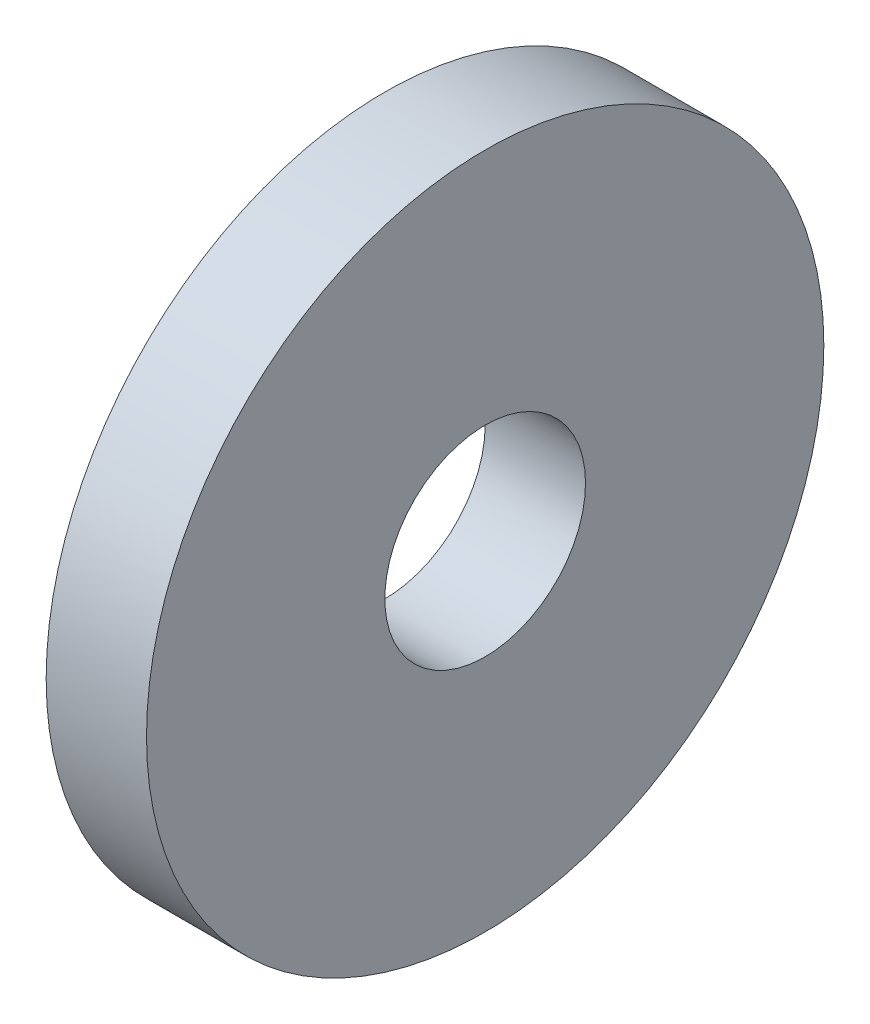
ISO-10303-21;
HEADER;
FILE_DESCRIPTION(('STEP AP214'),'2;1');
FILE_NAME('part.step','',(''),(''),'','','');
FILE_SCHEMA(('AUTOMOTIVE_DESIGN { 1 0 10303 214 1 1 1 1 }'));
ENDSEC;
DATA;
#1=APPLICATION_CONTEXT('core data for automotive mechanical design processes');
#2=APPLICATION_PROTOCOL_DEFINITION('international standard','automotive_design',2000,#1);
#3=PRODUCT_CONTEXT('',#1,'mechanical');
#4=PRODUCT('Part','Part','',(#3));
#5=PRODUCT_RELATED_PRODUCT_CATEGORY('part','',(#4));
#6=PRODUCT_DEFINITION_FORMATION('','',#4);
#7=PRODUCT_DEFINITION_CONTEXT('part definition',#1,'design');
#8=PRODUCT_DEFINITION('design','',#6,#7);
#9=PRODUCT_DEFINITION_SHAPE('','',#8);
#10=(LENGTH_UNIT() NAMED_UNIT(*) SI_UNIT(.MILLI.,.METRE.));
#11=(NAMED_UNIT(*) PLANE_ANGLE_UNIT() SI_UNIT($,.RADIAN.));
#12=(NAMED_UNIT(*) SI_UNIT($,.STERADIAN.) SOLID_ANGLE_UNIT());
#13=UNCERTAINTY_MEASURE_WITH_UNIT(LENGTH_MEASURE(1.E-05),#10,'distance_accuracy_value','');
#14=(GEOMETRIC_REPRESENTATION_CONTEXT(3) GLOBAL_UNCERTAINTY_ASSIGNED_CONTEXT((#13)) GLOBAL_UNIT_ASSIGNED_CONTEXT((#10,
#11,#12)) REPRESENTATION_CONTEXT('',''));
#15=CARTESIAN_POINT('',(0.,0.,0.));
#16=DIRECTION('',(0.,0.,1.));
#17=DIRECTION('',(1.,0.,0.));
#18=AXIS2_PLACEMENT_3D('',#15,#16,#17);
#19=CARTESIAN_POINT('',(2.,0.,0.));
#20=DIRECTION('',(-1.,0.,0.));
#21=DIRECTION('',(0.,0.,1.));
#22=AXIS2_PLACEMENT_3D('',#19,#20,#21);
#23=CYLINDRICAL_SURFACE('',#22,6.75);
#24=CARTESIAN_POINT('',(2.,0.,0.));
#25=DIRECTION('',(1.,0.,0.));
#26=DIRECTION('',(0.,0.,-1.));
#27=AXIS2_PLACEMENT_3D('',#24,#25,#26);
#28=CIRCLE('',#27,6.75);
#29=CARTESIAN_POINT('',(2.,0.,-6.75));
#30=VERTEX_POINT('',#29);
#31=EDGE_CURVE('E10',#30,#30,#28,.T.);
#32=ORIENTED_EDGE('',*,*,#31,.F.);
#33=EDGE_LOOP('',(#32));
#34=FACE_BOUND('',#33,.T.);
#35=CARTESIAN_POINT('',(0.,0.,0.));
#36=DIRECTION('',(1.,0.,0.));
#37=DIRECTION('',(0.,0.,-1.));
#38=AXIS2_PLACEMENT_3D('',#35,#36,#37);
#39=CIRCLE('',#38,6.75);
#40=CARTESIAN_POINT('',(0.,0.,-6.75));
#41=VERTEX_POINT('',#40);
#42=EDGE_CURVE('E34',#41,#41,#39,.T.);
#43=ORIENTED_EDGE('',*,*,#42,.T.);
#44=EDGE_LOOP('',(#43));
#45=FACE_BOUND('',#44,.T.);
#46=ADVANCED_FACE('F31',(#34,#45),#23,.T.);
#47=CARTESIAN_POINT('',(2.,0.,0.));
#48=DIRECTION('',(1.,0.,0.));
#49=DIRECTION('',(0.,0.,-1.));
#50=AXIS2_PLACEMENT_3D('',#47,#48,#49);
#51=PLANE('',#50);
#52=CARTESIAN_POINT('',(2.,0.,0.));
#53=DIRECTION('',(1.,0.,0.));
#54=DIRECTION('',(0.,0.,-1.));
#55=AXIS2_PLACEMENT_3D('',#52,#53,#54);
#56=CIRCLE('',#55,2.);
#57=CARTESIAN_POINT('',(2.,0.,-2.));
#58=VERTEX_POINT('',#57);
#59=EDGE_CURVE('E43',#58,#58,#56,.T.);
#60=ORIENTED_EDGE('',*,*,#59,.F.);
#61=EDGE_LOOP('',(#60));
#62=FACE_BOUND('',#61,.T.);
#63=ORIENTED_EDGE('',*,*,#31,.T.);
#64=EDGE_LOOP('',(#63));
#65=FACE_BOUND('',#64,.T.);
#66=ADVANCED_FACE('F58',(#62,#65),#51,.T.);
#67=CARTESIAN_POINT('',(0.,0.,0.));
#68=DIRECTION('',(1.,0.,0.));
#69=DIRECTION('',(0.,0.,-1.));
#70=AXIS2_PLACEMENT_3D('',#67,#68,#69);
#71=PLANE('',#70);
#72=CARTESIAN_POINT('',(0.,0.,0.));
#73=DIRECTION('',(1.,0.,0.));
#74=DIRECTION('',(0.,0.,-1.));
#75=AXIS2_PLACEMENT_3D('',#72,#73,#74);
#76=CIRCLE('',#75,2.);
#77=CARTESIAN_POINT('',(0.,0.,-2.));
#78=VERTEX_POINT('',#77);
#79=EDGE_CURVE('E41',#78,#78,#76,.T.);
#80=ORIENTED_EDGE('',*,*,#79,.T.);
#81=EDGE_LOOP('',(#80));
#82=FACE_BOUND('',#81,.T.);
#83=ORIENTED_EDGE('',*,*,#42,.F.);
#84=EDGE_LOOP('',(#83));
#85=FACE_BOUND('',#84,.T.);
#86=ADVANCED_FACE('F49',(#82,#85),#71,.F.);
#87=CARTESIAN_POINT('',(0.,0.,0.));
#88=DIRECTION('',(1.,0.,0.));
#89=DIRECTION('',(0.,0.,-1.));
#90=AXIS2_PLACEMENT_3D('',#87,#88,#89);
#91=CYLINDRICAL_SURFACE('',#90,2.);
#92=ORIENTED_EDGE('',*,*,#79,.F.);
#93=EDGE_LOOP('',(#92));
#94=FACE_BOUND('',#93,.T.);
#95=ORIENTED_EDGE('',*,*,#59,.T.);
#96=EDGE_LOOP('',(#95));
#97=FACE_BOUND('',#96,.T.);
#98=ADVANCED_FACE('F52',(#94,#97),#91,.F.);
#99=CLOSED_SHELL('',(#46,#66,#86,#98));
#100=MANIFOLD_SOLID_BREP('B2',#99);
#101=ADVANCED_BREP_SHAPE_REPRESENTATION('',(#18,#100),#14);
#102=SHAPE_DEFINITION_REPRESENTATION(#9,#101);
ENDSEC;
END-ISO-10303-21;
